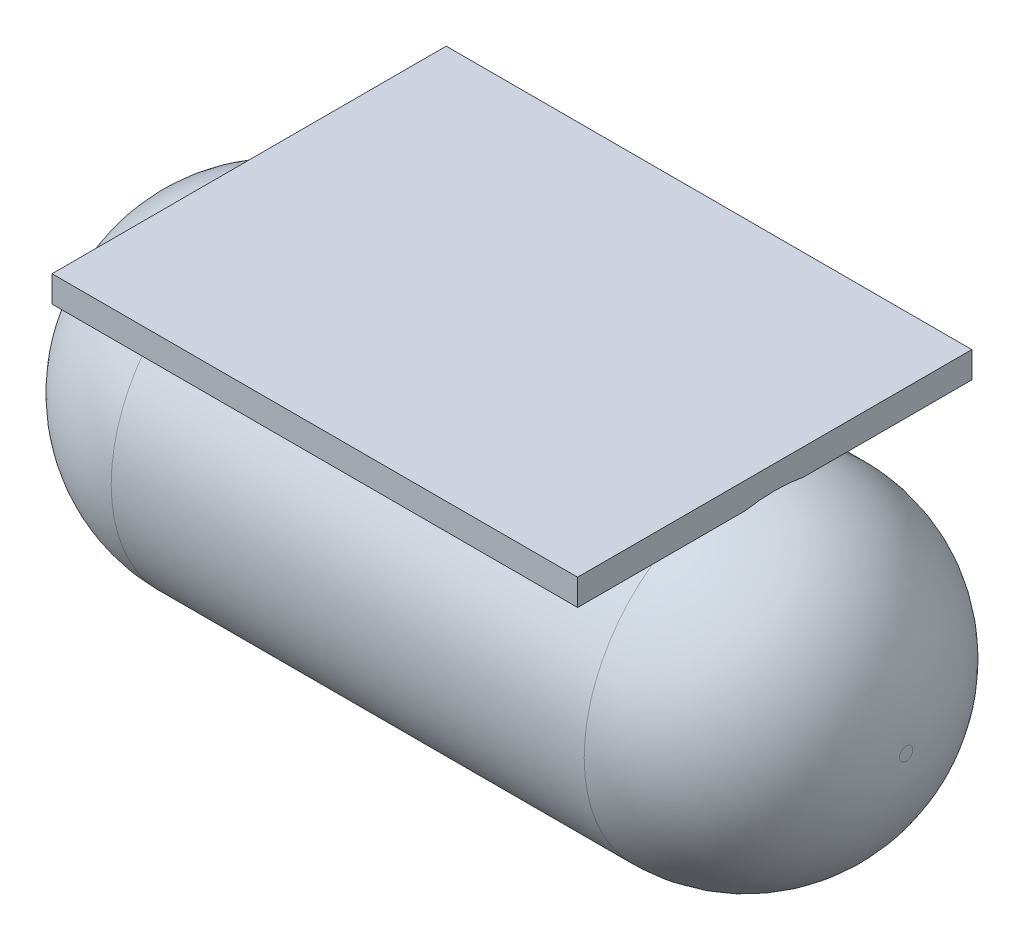
ISO-10303-21;
HEADER;
FILE_DESCRIPTION(('STEP AP214'),'2;1');
FILE_NAME('part.step','',(''),(''),'','','');
FILE_SCHEMA(('AUTOMOTIVE_DESIGN { 1 0 10303 214 1 1 1 1 }'));
ENDSEC;
DATA;
#1=APPLICATION_CONTEXT('core data for automotive mechanical design processes');
#2=APPLICATION_PROTOCOL_DEFINITION('international standard','automotive_design',2000,#1);
#3=PRODUCT_CONTEXT('',#1,'mechanical');
#4=PRODUCT('Part','Part','',(#3));
#5=PRODUCT_RELATED_PRODUCT_CATEGORY('part','',(#4));
#6=PRODUCT_DEFINITION_FORMATION('','',#4);
#7=PRODUCT_DEFINITION_CONTEXT('part definition',#1,'design');
#8=PRODUCT_DEFINITION('design','',#6,#7);
#9=PRODUCT_DEFINITION_SHAPE('','',#8);
#10=(LENGTH_UNIT() NAMED_UNIT(*) SI_UNIT(.MILLI.,.METRE.));
#11=(NAMED_UNIT(*) PLANE_ANGLE_UNIT() SI_UNIT($,.RADIAN.));
#12=(NAMED_UNIT(*) SI_UNIT($,.STERADIAN.) SOLID_ANGLE_UNIT());
#13=UNCERTAINTY_MEASURE_WITH_UNIT(LENGTH_MEASURE(1.E-05),#10,'distance_accuracy_value','');
#14=(GEOMETRIC_REPRESENTATION_CONTEXT(3) GLOBAL_UNCERTAINTY_ASSIGNED_CONTEXT((#13)) GLOBAL_UNIT_ASSIGNED_CONTEXT((#10,
#11,#12)) REPRESENTATION_CONTEXT('',''));
#15=CARTESIAN_POINT('',(0.,0.,0.));
#16=DIRECTION('',(0.,0.,1.));
#17=DIRECTION('',(1.,0.,0.));
#18=AXIS2_PLACEMENT_3D('',#15,#16,#17);
#19=CARTESIAN_POINT('',(0.,0.,0.));
#20=DIRECTION('',(0.,-1.,0.));
#21=DIRECTION('',(0.,0.,-1.));
#22=AXIS2_PLACEMENT_3D('',#19,#20,#21);
#23=PLANE('',#22);
#24=DIRECTION('',(1.,0.,0.));
#25=VECTOR('',#24,1.);
#26=CARTESIAN_POINT('',(-2.54,0.,-4.57858597816691));
#27=LINE('',#26,#25);
#28=CARTESIAN_POINT('',(0.508000000000023,0.,-4.57858597816691));
#29=VERTEX_POINT('',#28);
#30=CARTESIAN_POINT('',(9.65200000000008,0.,-4.57858597816691));
#31=VERTEX_POINT('',#30);
#32=EDGE_CURVE('E142',#29,#31,#27,.T.);
#33=ORIENTED_EDGE('',*,*,#32,.F.);
#34=CARTESIAN_POINT('',(0.508000000000024,0.,-4.5785859781669));
#35=CARTESIAN_POINT('',(0.46612613686911,0.,-4.57862716563983));
#36=CARTESIAN_POINT('',(0.424266603895928,0.,-4.57502441499485));
#37=CARTESIAN_POINT('',(0.341726882052422,0.,-4.56082153697278));
#38=CARTESIAN_POINT('',(0.301047316259463,0.,-4.55021778051505));
#39=CARTESIAN_POINT('',(0.222045856008195,0.,-4.52229751155312));
#40=CARTESIAN_POINT('',(0.183725058928042,0.,-4.50497790155475));
#41=CARTESIAN_POINT('',(0.110595146566699,0.,-4.4642064626237));
#42=CARTESIAN_POINT('',(0.0757784007284716,0.,-4.44076837621584));
#43=CARTESIAN_POINT('',(0.0283015525773906,0.,-4.40274092878074));
#44=CARTESIAN_POINT('',(0.0138995892610691,0.,-4.39028231770508));
#45=CARTESIAN_POINT('',(-3.14907065303937E-12,0.,-4.37730239944156));
#46=B_SPLINE_CURVE_WITH_KNOTS('',3,(#34,#35,#36,#37,#38,#39,#40,#41,#42,#43,#44,#45),
.UNSPECIFIED.,.F.,.F.,(4,2,2,2,2,4),(0.,0.125446399473468,0.250957877154219,0.376527312380034,
0.501817100911504,0.558886966219512),.UNSPECIFIED.);
#47=CARTESIAN_POINT('',(0.,0.,-4.37730239943762));
#48=VERTEX_POINT('',#47);
#49=EDGE_CURVE('E159',#29,#48,#46,.T.);
#50=ORIENTED_EDGE('',*,*,#49,.T.);
#51=DIRECTION('',(0.,0.,1.));
#52=VECTOR('',#51,1.);
#53=CARTESIAN_POINT('',(0.,0.,0.));
#54=LINE('',#53,#52);
#55=CARTESIAN_POINT('',(0.,0.,-7.62));
#56=VERTEX_POINT('',#55);
#57=EDGE_CURVE('E219',#56,#48,#54,.T.);
#58=ORIENTED_EDGE('',*,*,#57,.F.);
#59=DIRECTION('',(-1.,0.,0.));
#60=VECTOR('',#59,1.);
#61=CARTESIAN_POINT('',(0.,0.,-7.62));
#62=LINE('',#61,#60);
#63=CARTESIAN_POINT('',(10.16,0.,-7.62));
#64=VERTEX_POINT('',#63);
#65=EDGE_CURVE('E131',#64,#56,#62,.T.);
#66=ORIENTED_EDGE('',*,*,#65,.F.);
#67=DIRECTION('',(0.,0.,-1.));
#68=VECTOR('',#67,1.);
#69=CARTESIAN_POINT('',(10.16,0.,0.));
#70=LINE('',#69,#68);
#71=CARTESIAN_POINT('',(10.16,0.,-4.37730239943763));
#72=VERTEX_POINT('',#71);
#73=EDGE_CURVE('E60',#72,#64,#70,.T.);
#74=ORIENTED_EDGE('',*,*,#73,.F.);
#75=CARTESIAN_POINT('',(10.16,0.,-4.37730239943763));
#76=CARTESIAN_POINT('',(10.1294165780914,0.,-4.40589907859528));
#77=CARTESIAN_POINT('',(10.0964139316205,0.,-4.4319078201446));
#78=CARTESIAN_POINT('',(10.0264971424081,0.,-4.47813586417024));
#79=CARTESIAN_POINT('',(9.98957659119149,0.,-4.49834547471949));
#80=CARTESIAN_POINT('',(9.91281787009416,0.,-4.53228054234266));
#81=CARTESIAN_POINT('',(9.87297660474412,0.,-4.54599900169716));
#82=CARTESIAN_POINT('',(9.79163560440805,0.,-4.56645983117183));
#83=CARTESIAN_POINT('',(9.75014058970243,0.,-4.57322075968539));
#84=CARTESIAN_POINT('',(9.68963429554306,0.,-4.57786897966157));
#85=CARTESIAN_POINT('',(9.67081187198476,0.,-4.57859175601438));
#86=CARTESIAN_POINT('',(9.65200000000047,0.,-4.57858597817191));
#87=B_SPLINE_CURVE_WITH_KNOTS('',3,(#75,#76,#77,#78,#79,#80,#81,#82,#83,#84,#85,#86),
.UNSPECIFIED.,.F.,.F.,(4,2,2,2,2,4),(0.,0.125469605899347,0.251147700363784,0.376960973861863,
0.502437778530011,0.558887887528422),.UNSPECIFIED.);
#88=EDGE_CURVE('E11',#72,#31,#87,.T.);
#89=ORIENTED_EDGE('',*,*,#88,.T.);
#90=EDGE_LOOP('',(#33,#50,#58,#66,#74,#89));
#91=FACE_BOUND('',#90,.T.);
#92=ADVANCED_FACE('F39',(#91),#23,.T.);
#93=CARTESIAN_POINT('',(0.,0.508,0.));
#94=DIRECTION('',(1.,0.,0.));
#95=DIRECTION('',(0.,0.,-1.));
#96=AXIS2_PLACEMENT_3D('',#93,#94,#95);
#97=PLANE('',#96);
#98=ORIENTED_EDGE('',*,*,#57,.T.);
#99=CARTESIAN_POINT('',(0.,-3.08056822585789,-3.81));
#100=DIRECTION('',(1.,0.,0.));
#101=DIRECTION('',(0.,0.,-1.));
#102=AXIS2_PLACEMENT_3D('',#99,#100,#101);
#103=CIRCLE('',#102,3.13236852981461);
#104=CARTESIAN_POINT('',(0.,0.,-3.24269760056237));
#105=VERTEX_POINT('',#104);
#106=EDGE_CURVE('E167',#48,#105,#103,.T.);
#107=ORIENTED_EDGE('',*,*,#106,.T.);
#108=CARTESIAN_POINT('',(0.,0.,0.));
#109=VERTEX_POINT('',#108);
#110=EDGE_CURVE('E135',#105,#109,#54,.T.);
#111=ORIENTED_EDGE('',*,*,#110,.T.);
#112=DIRECTION('',(0.,-1.,0.));
#113=VECTOR('',#112,1.);
#114=CARTESIAN_POINT('',(0.,0.508,0.));
#115=LINE('',#114,#113);
#116=CARTESIAN_POINT('',(0.,0.508,0.));
#117=VERTEX_POINT('',#116);
#118=EDGE_CURVE('E115',#117,#109,#115,.T.);
#119=ORIENTED_EDGE('',*,*,#118,.F.);
#120=DIRECTION('',(0.,0.,1.));
#121=VECTOR('',#120,1.);
#122=CARTESIAN_POINT('',(0.,0.508,0.));
#123=LINE('',#122,#121);
#124=CARTESIAN_POINT('',(0.,0.508,-7.62));
#125=VERTEX_POINT('',#124);
#126=EDGE_CURVE('E121',#125,#117,#123,.T.);
#127=ORIENTED_EDGE('',*,*,#126,.F.);
#128=DIRECTION('',(0.,-1.,0.));
#129=VECTOR('',#128,1.);
#130=CARTESIAN_POINT('',(0.,0.508,-7.62));
#131=LINE('',#130,#129);
#132=EDGE_CURVE('E233',#125,#56,#131,.T.);
#133=ORIENTED_EDGE('',*,*,#132,.T.);
#134=EDGE_LOOP('',(#98,#107,#111,#119,#127,#133));
#135=FACE_BOUND('',#134,.T.);
#136=ADVANCED_FACE('F133',(#135),#97,.F.);
#137=CARTESIAN_POINT('',(0.,0.508,0.));
#138=DIRECTION('',(0.,0.,-1.));
#139=DIRECTION('',(-1.,0.,0.));
#140=AXIS2_PLACEMENT_3D('',#137,#138,#139);
#141=PLANE('',#140);
#142=DIRECTION('',(1.,0.,0.));
#143=VECTOR('',#142,1.);
#144=CARTESIAN_POINT('',(0.,0.,0.));
#145=LINE('',#144,#143);
#146=CARTESIAN_POINT('',(10.16,0.,0.));
#147=VERTEX_POINT('',#146);
#148=EDGE_CURVE('E221',#109,#147,#145,.T.);
#149=ORIENTED_EDGE('',*,*,#148,.T.);
#150=DIRECTION('',(0.,-1.,0.));
#151=VECTOR('',#150,1.);
#152=CARTESIAN_POINT('',(10.16,0.508,0.));
#153=LINE('',#152,#151);
#154=CARTESIAN_POINT('',(10.16,0.508,0.));
#155=VERTEX_POINT('',#154);
#156=EDGE_CURVE('E116',#155,#147,#153,.T.);
#157=ORIENTED_EDGE('',*,*,#156,.F.);
#158=DIRECTION('',(1.,0.,0.));
#159=VECTOR('',#158,1.);
#160=CARTESIAN_POINT('',(0.,0.508,0.));
#161=LINE('',#160,#159);
#162=EDGE_CURVE('E111',#117,#155,#161,.T.);
#163=ORIENTED_EDGE('',*,*,#162,.F.);
#164=ORIENTED_EDGE('',*,*,#118,.T.);
#165=EDGE_LOOP('',(#149,#157,#163,#164));
#166=FACE_BOUND('',#165,.T.);
#167=ADVANCED_FACE('F113',(#166),#141,.F.);
#168=CARTESIAN_POINT('',(10.16,0.508,0.));
#169=DIRECTION('',(-1.,0.,0.));
#170=DIRECTION('',(0.,0.,1.));
#171=AXIS2_PLACEMENT_3D('',#168,#169,#170);
#172=PLANE('',#171);
#173=CARTESIAN_POINT('',(10.16,0.,-3.24269760056237));
#174=VERTEX_POINT('',#173);
#175=EDGE_CURVE('E67',#147,#174,#70,.T.);
#176=ORIENTED_EDGE('',*,*,#175,.T.);
#177=CARTESIAN_POINT('',(10.16,-3.08056822585789,-3.81));
#178=DIRECTION('',(1.,0.,0.));
#179=DIRECTION('',(0.,0.,-1.));
#180=AXIS2_PLACEMENT_3D('',#177,#178,#179);
#181=CIRCLE('',#180,3.13236852981461);
#182=EDGE_CURVE('E54',#174,#72,#181,.F.);
#183=ORIENTED_EDGE('',*,*,#182,.T.);
#184=ORIENTED_EDGE('',*,*,#73,.T.);
#185=DIRECTION('',(0.,-1.,0.));
#186=VECTOR('',#185,1.);
#187=CARTESIAN_POINT('',(10.16,0.508,-7.62));
#188=LINE('',#187,#186);
#189=CARTESIAN_POINT('',(10.16,0.508,-7.62));
#190=VERTEX_POINT('',#189);
#191=EDGE_CURVE('E144',#190,#64,#188,.T.);
#192=ORIENTED_EDGE('',*,*,#191,.F.);
#193=DIRECTION('',(0.,0.,-1.));
#194=VECTOR('',#193,1.);
#195=CARTESIAN_POINT('',(10.16,0.508,0.));
#196=LINE('',#195,#194);
#197=EDGE_CURVE('E120',#155,#190,#196,.T.);
#198=ORIENTED_EDGE('',*,*,#197,.F.);
#199=ORIENTED_EDGE('',*,*,#156,.T.);
#200=EDGE_LOOP('',(#176,#183,#184,#192,#198,#199));
#201=FACE_BOUND('',#200,.T.);
#202=ADVANCED_FACE('F203',(#201),#172,.F.);
#203=CARTESIAN_POINT('',(0.,0.508,-7.62));
#204=DIRECTION('',(0.,0.,1.));
#205=DIRECTION('',(1.,0.,0.));
#206=AXIS2_PLACEMENT_3D('',#203,#204,#205);
#207=PLANE('',#206);
#208=ORIENTED_EDGE('',*,*,#65,.T.);
#209=ORIENTED_EDGE('',*,*,#132,.F.);
#210=DIRECTION('',(-1.,0.,0.));
#211=VECTOR('',#210,1.);
#212=CARTESIAN_POINT('',(0.,0.508,-7.62));
#213=LINE('',#212,#211);
#214=EDGE_CURVE('E126',#190,#125,#213,.T.);
#215=ORIENTED_EDGE('',*,*,#214,.F.);
#216=ORIENTED_EDGE('',*,*,#191,.T.);
#217=EDGE_LOOP('',(#208,#209,#215,#216));
#218=FACE_BOUND('',#217,.T.);
#219=ADVANCED_FACE('F180',(#218),#207,.F.);
#220=CARTESIAN_POINT('',(0.,0.508,0.));
#221=DIRECTION('',(0.,-1.,0.));
#222=DIRECTION('',(0.,0.,-1.));
#223=AXIS2_PLACEMENT_3D('',#220,#221,#222);
#224=PLANE('',#223);
#225=ORIENTED_EDGE('',*,*,#126,.T.);
#226=ORIENTED_EDGE('',*,*,#162,.T.);
#227=ORIENTED_EDGE('',*,*,#197,.T.);
#228=ORIENTED_EDGE('',*,*,#214,.T.);
#229=EDGE_LOOP('',(#225,#226,#227,#228));
#230=FACE_BOUND('',#229,.T.);
#231=ADVANCED_FACE('F124',(#230),#224,.F.);
#232=DIRECTION('',(1.,0.,0.));
#233=VECTOR('',#232,1.);
#234=CARTESIAN_POINT('',(-2.54,0.,-3.04141402183309));
#235=LINE('',#234,#233);
#236=CARTESIAN_POINT('',(9.65200000000008,0.,-3.04141402183309));
#237=VERTEX_POINT('',#236);
#238=CARTESIAN_POINT('',(0.508000000000023,0.,-3.04141402183309));
#239=VERTEX_POINT('',#238);
#240=EDGE_CURVE('E138',#237,#239,#235,.F.);
#241=ORIENTED_EDGE('',*,*,#240,.F.);
#242=CARTESIAN_POINT('',(9.65200000000008,0.,-3.04141402183309));
#243=CARTESIAN_POINT('',(9.693873863131,0.,-3.04137283436018));
#244=CARTESIAN_POINT('',(9.73573339610418,0.,-3.04497558500517));
#245=CARTESIAN_POINT('',(9.81827311794768,0.,-3.05917846302724));
#246=CARTESIAN_POINT('',(9.85895268374064,0.,-3.06978221948498));
#247=CARTESIAN_POINT('',(9.93795414399191,0.,-3.09770248844692));
#248=CARTESIAN_POINT('',(9.97627494107206,0.,-3.11502209844529));
#249=CARTESIAN_POINT('',(10.0494048534334,0.,-3.15579353737635));
#250=CARTESIAN_POINT('',(10.0842215992716,0.,-3.17923162378422));
#251=CARTESIAN_POINT('',(10.1316984474227,0.,-3.2172590712193));
#252=CARTESIAN_POINT('',(10.146100410739,0.,-3.22971768229494));
#253=CARTESIAN_POINT('',(10.1600000000031,0.,-3.24269760055844));
#254=B_SPLINE_CURVE_WITH_KNOTS('',3,(#242,#243,#244,#245,#246,#247,#248,#249,#250,#251,#252,
#253),.UNSPECIFIED.,.F.,.F.,(4,2,2,2,2,4),(0.,0.125446399473468,0.250957877154219,
0.376527312380035,0.501817100911506,0.558886966219404),.UNSPECIFIED.);
#255=EDGE_CURVE('E192',#237,#174,#254,.T.);
#256=ORIENTED_EDGE('',*,*,#255,.T.);
#257=ORIENTED_EDGE('',*,*,#175,.F.);
#258=ORIENTED_EDGE('',*,*,#148,.F.);
#259=ORIENTED_EDGE('',*,*,#110,.F.);
#260=CARTESIAN_POINT('',(0.,0.,-3.24269760056237));
#261=CARTESIAN_POINT('',(0.0305834219085995,0.,-3.21410092140472));
#262=CARTESIAN_POINT('',(0.0635860683795279,0.,-3.1880921798554));
#263=CARTESIAN_POINT('',(0.133502857591862,0.,-3.14186413582976));
#264=CARTESIAN_POINT('',(0.170423408808508,0.,-3.12165452528051));
#265=CARTESIAN_POINT('',(0.247182129905842,0.,-3.08771945765734));
#266=CARTESIAN_POINT('',(0.287023395255879,0.,-3.07400099830284));
#267=CARTESIAN_POINT('',(0.36836439559195,0.,-3.05354016882817));
#268=CARTESIAN_POINT('',(0.409859410297573,0.,-3.04677924031461));
#269=CARTESIAN_POINT('',(0.470365704456973,0.,-3.04213102033843));
#270=CARTESIAN_POINT('',(0.48918812801531,0.,-3.04140824398562));
#271=CARTESIAN_POINT('',(0.50799999999964,0.,-3.04141402182809));
#272=B_SPLINE_CURVE_WITH_KNOTS('',3,(#260,#261,#262,#263,#264,#265,#266,#267,#268,#269,#270,
#271),.UNSPECIFIED.,.F.,.F.,(4,2,2,2,2,4),(0.,0.125469605899346,0.251147700363783,
0.376960973861862,0.502437778530009,0.55888788752853),.UNSPECIFIED.);
#273=EDGE_CURVE('E185',#105,#239,#272,.T.);
#274=ORIENTED_EDGE('',*,*,#273,.T.);
#275=EDGE_LOOP('',(#241,#256,#257,#258,#259,#274));
#276=FACE_BOUND('',#275,.T.);
#277=ADVANCED_FACE('F172',(#276),#23,.T.);
#278=CARTESIAN_POINT('',(-2.54,-3.08056822585789,-3.81));
#279=DIRECTION('',(1.,0.,0.));
#280=DIRECTION('',(0.,0.,-1.));
#281=AXIS2_PLACEMENT_3D('',#278,#279,#280);
#282=CYLINDRICAL_SURFACE('',#281,3.175);
#283=ORIENTED_EDGE('',*,*,#32,.T.);
#284=CARTESIAN_POINT('',(9.65200000000008,-3.08056822585789,-3.81));
#285=DIRECTION('',(1.,0.,0.));
#286=DIRECTION('',(0.,0.,-1.));
#287=AXIS2_PLACEMENT_3D('',#284,#285,#286);
#288=CIRCLE('',#287,3.175);
#289=EDGE_CURVE('E199',#31,#237,#288,.F.);
#290=ORIENTED_EDGE('',*,*,#289,.T.);
#291=ORIENTED_EDGE('',*,*,#240,.T.);
#292=CARTESIAN_POINT('',(0.508000000000024,-3.08056822585789,-3.81));
#293=DIRECTION('',(1.,0.,0.));
#294=DIRECTION('',(0.,0.,-1.));
#295=AXIS2_PLACEMENT_3D('',#292,#293,#294);
#296=CIRCLE('',#295,3.175);
#297=EDGE_CURVE('E151',#239,#29,#296,.T.);
#298=ORIENTED_EDGE('',*,*,#297,.T.);
#299=EDGE_LOOP('',(#283,#290,#291,#298));
#300=FACE_BOUND('',#299,.T.);
#301=ADVANCED_FACE('F177',(#300),#282,.T.);
#302=CARTESIAN_POINT('',(-2.54,-3.08056822585789,-3.81));
#303=DIRECTION('',(1.,0.,0.));
#304=DIRECTION('',(0.,0.,-1.));
#305=AXIS2_PLACEMENT_3D('',#302,#303,#304);
#306=PLANE('',#305);
#307=CARTESIAN_POINT('',(-2.54,-3.08056822585789,-3.81));
#308=DIRECTION('',(1.,0.,0.));
#309=DIRECTION('',(0.,0.,-1.));
#310=AXIS2_PLACEMENT_3D('',#307,#308,#309);
#311=CIRCLE('',#310,0.127000000000001);
#312=CARTESIAN_POINT('',(-2.54,-3.08056822585789,-3.937));
#313=VERTEX_POINT('',#312);
#314=EDGE_CURVE('E155',#313,#313,#311,.F.);
#315=ORIENTED_EDGE('',*,*,#314,.T.);
#316=EDGE_LOOP('',(#315));
#317=FACE_BOUND('',#316,.T.);
#318=ADVANCED_FACE('F281',(#317),#306,.F.);
#319=CARTESIAN_POINT('',(12.7,-3.08056822585789,-3.81));
#320=DIRECTION('',(1.,0.,0.));
#321=DIRECTION('',(0.,0.,-1.));
#322=AXIS2_PLACEMENT_3D('',#319,#320,#321);
#323=PLANE('',#322);
#324=CARTESIAN_POINT('',(12.7,-3.08056822585789,-3.81));
#325=DIRECTION('',(1.,0.,0.));
#326=DIRECTION('',(0.,0.,-1.));
#327=AXIS2_PLACEMENT_3D('',#324,#325,#326);
#328=CIRCLE('',#327,0.127000000000001);
#329=CARTESIAN_POINT('',(12.7,-3.08056822585789,-3.937));
#330=VERTEX_POINT('',#329);
#331=EDGE_CURVE('E241',#330,#330,#328,.T.);
#332=ORIENTED_EDGE('',*,*,#331,.T.);
#333=EDGE_LOOP('',(#332));
#334=FACE_BOUND('',#333,.T.);
#335=ADVANCED_FACE('F248',(#334),#323,.T.);
#336=CARTESIAN_POINT('',(0.508000000000003,-3.08056822585789,-3.81));
#337=DIRECTION('',(1.,0.,0.));
#338=DIRECTION('',(0.,0.,-1.));
#339=AXIS2_PLACEMENT_3D('',#336,#337,#338);
#340=DEGENERATE_TOROIDAL_SURFACE('',#339,0.127000000000001,3.048,.T.);
#341=ORIENTED_EDGE('',*,*,#314,.F.);
#342=EDGE_LOOP('',(#341));
#343=FACE_BOUND('',#342,.T.);
#344=ORIENTED_EDGE('',*,*,#49,.F.);
#345=ORIENTED_EDGE('',*,*,#297,.F.);
#346=ORIENTED_EDGE('',*,*,#273,.F.);
#347=ORIENTED_EDGE('',*,*,#106,.F.);
#348=EDGE_LOOP('',(#344,#345,#346,#347));
#349=FACE_BOUND('',#348,.T.);
#350=ADVANCED_FACE('F169',(#343,#349),#340,.T.);
#351=CARTESIAN_POINT('',(9.652,-3.08056822585789,-3.81));
#352=DIRECTION('',(1.,0.,0.));
#353=DIRECTION('',(0.,0.,-1.));
#354=AXIS2_PLACEMENT_3D('',#351,#352,#353);
#355=DEGENERATE_TOROIDAL_SURFACE('',#354,0.127000000000001,3.048,.T.);
#356=ORIENTED_EDGE('',*,*,#255,.F.);
#357=ORIENTED_EDGE('',*,*,#289,.F.);
#358=ORIENTED_EDGE('',*,*,#88,.F.);
#359=ORIENTED_EDGE('',*,*,#182,.F.);
#360=EDGE_LOOP('',(#356,#357,#358,#359));
#361=FACE_BOUND('',#360,.T.);
#362=ORIENTED_EDGE('',*,*,#331,.F.);
#363=EDGE_LOOP('',(#362));
#364=FACE_BOUND('',#363,.T.);
#365=ADVANCED_FACE('F41',(#361,#364),#355,.T.);
#366=CLOSED_SHELL('',(#92,#136,#167,#202,#219,#231,#277,#301,#318,#335,#350,#365));
#367=MANIFOLD_SOLID_BREP('B2',#366);
#368=ADVANCED_BREP_SHAPE_REPRESENTATION('',(#18,#367),#14);
#369=SHAPE_DEFINITION_REPRESENTATION(#9,#368);
ENDSEC;
END-ISO-10303-21;
